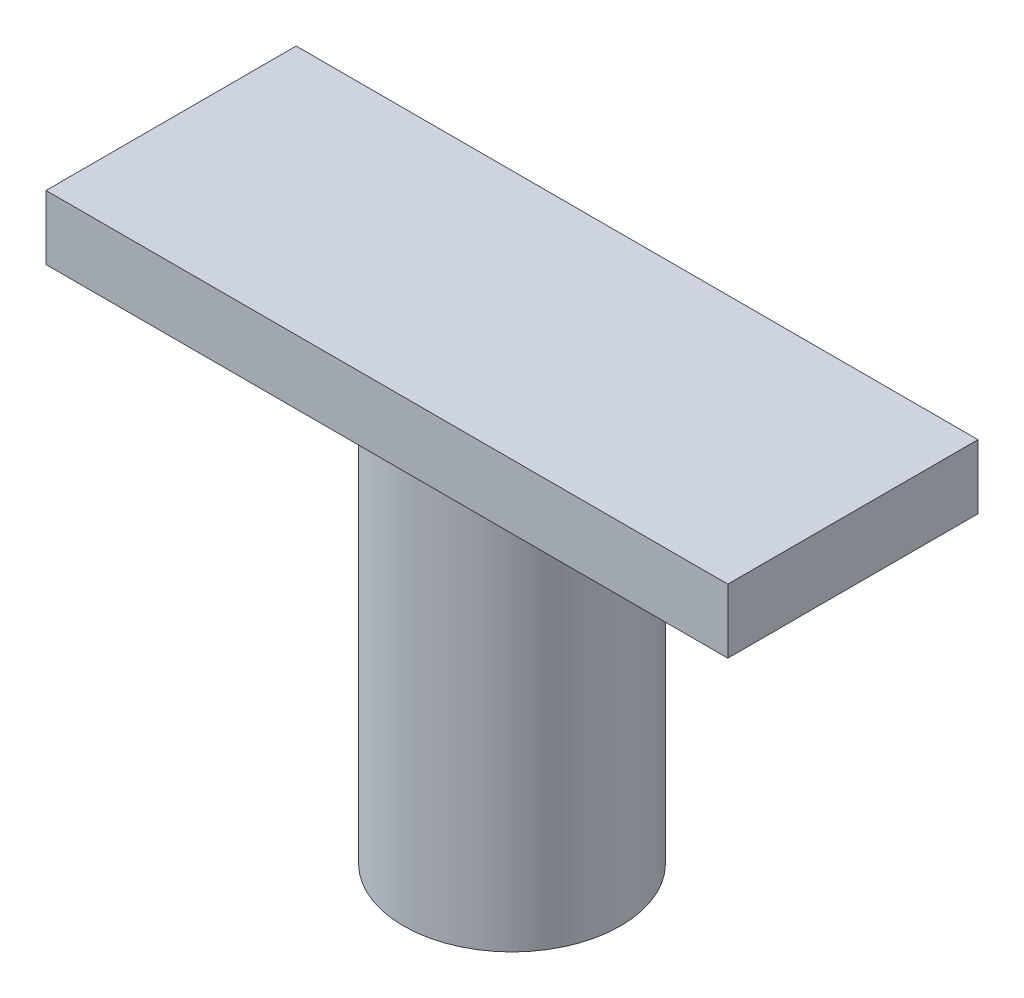
ISO-10303-21;
HEADER;
FILE_DESCRIPTION(('STEP AP214'),'2;1');
FILE_NAME('part.step','',(''),(''),'','','');
FILE_SCHEMA(('AUTOMOTIVE_DESIGN { 1 0 10303 214 1 1 1 1 }'));
ENDSEC;
DATA;
#1=APPLICATION_CONTEXT('core data for automotive mechanical design processes');
#2=APPLICATION_PROTOCOL_DEFINITION('international standard','automotive_design',2000,#1);
#3=PRODUCT_CONTEXT('',#1,'mechanical');
#4=PRODUCT('Part','Part','',(#3));
#5=PRODUCT_RELATED_PRODUCT_CATEGORY('part','',(#4));
#6=PRODUCT_DEFINITION_FORMATION('','',#4);
#7=PRODUCT_DEFINITION_CONTEXT('part definition',#1,'design');
#8=PRODUCT_DEFINITION('design','',#6,#7);
#9=PRODUCT_DEFINITION_SHAPE('','',#8);
#10=(LENGTH_UNIT() NAMED_UNIT(*) SI_UNIT(.MILLI.,.METRE.));
#11=(NAMED_UNIT(*) PLANE_ANGLE_UNIT() SI_UNIT($,.RADIAN.));
#12=(NAMED_UNIT(*) SI_UNIT($,.STERADIAN.) SOLID_ANGLE_UNIT());
#13=UNCERTAINTY_MEASURE_WITH_UNIT(LENGTH_MEASURE(1.E-05),#10,'distance_accuracy_value','');
#14=(GEOMETRIC_REPRESENTATION_CONTEXT(3) GLOBAL_UNCERTAINTY_ASSIGNED_CONTEXT((#13)) GLOBAL_UNIT_ASSIGNED_CONTEXT((#10,
#11,#12)) REPRESENTATION_CONTEXT('',''));
#15=CARTESIAN_POINT('',(0.,0.,0.));
#16=DIRECTION('',(0.,0.,1.));
#17=DIRECTION('',(1.,0.,0.));
#18=AXIS2_PLACEMENT_3D('',#15,#16,#17);
#19=CARTESIAN_POINT('',(22.7297936303225,64.,8.23955019099192));
#20=DIRECTION('',(0.,-1.,0.));
#21=DIRECTION('',(0.,0.,-1.));
#22=AXIS2_PLACEMENT_3D('',#19,#20,#21);
#23=CYLINDRICAL_SURFACE('',#22,16.9166212319845);
#24=CARTESIAN_POINT('',(22.7297936303225,64.,8.23955019099192));
#25=DIRECTION('',(0.,1.,0.));
#26=DIRECTION('',(0.,0.,1.));
#27=AXIS2_PLACEMENT_3D('',#24,#25,#26);
#28=CIRCLE('',#27,16.9166212319845);
#29=CARTESIAN_POINT('',(22.7297936303225,64.,25.1561714229764));
#30=VERTEX_POINT('',#29);
#31=EDGE_CURVE('E11',#30,#30,#28,.T.);
#32=ORIENTED_EDGE('',*,*,#31,.F.);
#33=EDGE_LOOP('',(#32));
#34=FACE_BOUND('',#33,.T.);
#35=CARTESIAN_POINT('',(22.7297936303225,0.,8.23955019099192));
#36=DIRECTION('',(0.,1.,0.));
#37=DIRECTION('',(0.,0.,1.));
#38=AXIS2_PLACEMENT_3D('',#35,#36,#37);
#39=CIRCLE('',#38,16.9166212319845);
#40=CARTESIAN_POINT('',(22.7297936303225,0.,25.1561714229764));
#41=VERTEX_POINT('',#40);
#42=EDGE_CURVE('E37',#41,#41,#39,.T.);
#43=ORIENTED_EDGE('',*,*,#42,.T.);
#44=EDGE_LOOP('',(#43));
#45=FACE_BOUND('',#44,.T.);
#46=ADVANCED_FACE('F34',(#34,#45),#23,.T.);
#47=CARTESIAN_POINT('',(22.7297936303225,0.,8.23955019099192));
#48=DIRECTION('',(0.,1.,0.));
#49=DIRECTION('',(0.,0.,1.));
#50=AXIS2_PLACEMENT_3D('',#47,#48,#49);
#51=PLANE('',#50);
#52=ORIENTED_EDGE('',*,*,#42,.F.);
#53=EDGE_LOOP('',(#52));
#54=FACE_BOUND('',#53,.T.);
#55=ADVANCED_FACE('F113',(#54),#51,.F.);
#56=CARTESIAN_POINT('',(75.8612808741503,74.,27.7333898328038));
#57=DIRECTION('',(-1.,0.,0.));
#58=DIRECTION('',(0.,0.,1.));
#59=AXIS2_PLACEMENT_3D('',#56,#57,#58);
#60=PLANE('',#59);
#61=DIRECTION('',(0.,0.,-1.));
#62=VECTOR('',#61,1.);
#63=CARTESIAN_POINT('',(75.8612808741503,64.,27.7333898328038));
#64=LINE('',#63,#62);
#65=CARTESIAN_POINT('',(75.8612808741503,64.,27.7333898328038));
#66=VERTEX_POINT('',#65);
#67=CARTESIAN_POINT('',(75.8612808741503,64.,-11.25428945082));
#68=VERTEX_POINT('',#67);
#69=EDGE_CURVE('E101',#66,#68,#64,.T.);
#70=ORIENTED_EDGE('',*,*,#69,.T.);
#71=DIRECTION('',(0.,-1.,0.));
#72=VECTOR('',#71,1.);
#73=CARTESIAN_POINT('',(75.8612808741503,74.,-11.25428945082));
#74=LINE('',#73,#72);
#75=CARTESIAN_POINT('',(75.8612808741503,74.,-11.25428945082));
#76=VERTEX_POINT('',#75);
#77=EDGE_CURVE('E92',#76,#68,#74,.T.);
#78=ORIENTED_EDGE('',*,*,#77,.F.);
#79=DIRECTION('',(0.,0.,-1.));
#80=VECTOR('',#79,1.);
#81=CARTESIAN_POINT('',(75.8612808741503,74.,27.7333898328038));
#82=LINE('',#81,#80);
#83=CARTESIAN_POINT('',(75.8612808741503,74.,27.7333898328038));
#84=VERTEX_POINT('',#83);
#85=EDGE_CURVE('E86',#84,#76,#82,.T.);
#86=ORIENTED_EDGE('',*,*,#85,.F.);
#87=DIRECTION('',(0.,-1.,0.));
#88=VECTOR('',#87,1.);
#89=CARTESIAN_POINT('',(75.8612808741503,74.,27.7333898328038));
#90=LINE('',#89,#88);
#91=EDGE_CURVE('E97',#84,#66,#90,.T.);
#92=ORIENTED_EDGE('',*,*,#91,.T.);
#93=EDGE_LOOP('',(#70,#78,#86,#92));
#94=FACE_BOUND('',#93,.T.);
#95=ADVANCED_FACE('F115',(#94),#60,.F.);
#96=CARTESIAN_POINT('',(-30.4016936135053,74.,-11.25428945082));
#97=DIRECTION('',(0.,0.,1.));
#98=DIRECTION('',(1.,0.,0.));
#99=AXIS2_PLACEMENT_3D('',#96,#97,#98);
#100=PLANE('',#99);
#101=DIRECTION('',(-1.,0.,0.));
#102=VECTOR('',#101,1.);
#103=CARTESIAN_POINT('',(-30.4016936135053,64.,-11.25428945082));
#104=LINE('',#103,#102);
#105=CARTESIAN_POINT('',(-30.4016936135053,64.,-11.25428945082));
#106=VERTEX_POINT('',#105);
#107=EDGE_CURVE('E91',#68,#106,#104,.T.);
#108=ORIENTED_EDGE('',*,*,#107,.T.);
#109=DIRECTION('',(0.,-1.,0.));
#110=VECTOR('',#109,1.);
#111=CARTESIAN_POINT('',(-30.4016936135053,74.,-11.25428945082));
#112=LINE('',#111,#110);
#113=CARTESIAN_POINT('',(-30.4016936135053,74.,-11.25428945082));
#114=VERTEX_POINT('',#113);
#115=EDGE_CURVE('E89',#114,#106,#112,.T.);
#116=ORIENTED_EDGE('',*,*,#115,.F.);
#117=DIRECTION('',(-1.,0.,0.));
#118=VECTOR('',#117,1.);
#119=CARTESIAN_POINT('',(-30.4016936135053,74.,-11.25428945082));
#120=LINE('',#119,#118);
#121=EDGE_CURVE('E81',#76,#114,#120,.T.);
#122=ORIENTED_EDGE('',*,*,#121,.F.);
#123=ORIENTED_EDGE('',*,*,#77,.T.);
#124=EDGE_LOOP('',(#108,#116,#122,#123));
#125=FACE_BOUND('',#124,.T.);
#126=ADVANCED_FACE('F90',(#125),#100,.F.);
#127=CARTESIAN_POINT('',(-30.4016936135053,74.,27.7333898328038));
#128=DIRECTION('',(1.,0.,0.));
#129=DIRECTION('',(0.,0.,-1.));
#130=AXIS2_PLACEMENT_3D('',#127,#128,#129);
#131=PLANE('',#130);
#132=DIRECTION('',(0.,0.,1.));
#133=VECTOR('',#132,1.);
#134=CARTESIAN_POINT('',(-30.4016936135053,64.,27.7333898328038));
#135=LINE('',#134,#133);
#136=CARTESIAN_POINT('',(-30.4016936135053,64.,27.7333898328038));
#137=VERTEX_POINT('',#136);
#138=EDGE_CURVE('E67',#106,#137,#135,.T.);
#139=ORIENTED_EDGE('',*,*,#138,.T.);
#140=DIRECTION('',(0.,-1.,0.));
#141=VECTOR('',#140,1.);
#142=CARTESIAN_POINT('',(-30.4016936135053,74.,27.7333898328038));
#143=LINE('',#142,#141);
#144=CARTESIAN_POINT('',(-30.4016936135053,74.,27.7333898328038));
#145=VERTEX_POINT('',#144);
#146=EDGE_CURVE('E93',#145,#137,#143,.T.);
#147=ORIENTED_EDGE('',*,*,#146,.F.);
#148=DIRECTION('',(0.,0.,1.));
#149=VECTOR('',#148,1.);
#150=CARTESIAN_POINT('',(-30.4016936135053,74.,27.7333898328038));
#151=LINE('',#150,#149);
#152=EDGE_CURVE('E84',#114,#145,#151,.T.);
#153=ORIENTED_EDGE('',*,*,#152,.F.);
#154=ORIENTED_EDGE('',*,*,#115,.T.);
#155=EDGE_LOOP('',(#139,#147,#153,#154));
#156=FACE_BOUND('',#155,.T.);
#157=ADVANCED_FACE('F95',(#156),#131,.F.);
#158=CARTESIAN_POINT('',(-30.4016936135053,74.,27.7333898328038));
#159=DIRECTION('',(0.,0.,-1.));
#160=DIRECTION('',(-1.,0.,0.));
#161=AXIS2_PLACEMENT_3D('',#158,#159,#160);
#162=PLANE('',#161);
#163=DIRECTION('',(1.,0.,0.));
#164=VECTOR('',#163,1.);
#165=CARTESIAN_POINT('',(-30.4016936135053,64.,27.7333898328038));
#166=LINE('',#165,#164);
#167=EDGE_CURVE('E73',#137,#66,#166,.T.);
#168=ORIENTED_EDGE('',*,*,#167,.T.);
#169=ORIENTED_EDGE('',*,*,#91,.F.);
#170=DIRECTION('',(1.,0.,0.));
#171=VECTOR('',#170,1.);
#172=CARTESIAN_POINT('',(-30.4016936135053,74.,27.7333898328038));
#173=LINE('',#172,#171);
#174=EDGE_CURVE('E50',#145,#84,#173,.T.);
#175=ORIENTED_EDGE('',*,*,#174,.F.);
#176=ORIENTED_EDGE('',*,*,#146,.T.);
#177=EDGE_LOOP('',(#168,#169,#175,#176));
#178=FACE_BOUND('',#177,.T.);
#179=ADVANCED_FACE('F128',(#178),#162,.F.);
#180=CARTESIAN_POINT('',(0.,74.,0.));
#181=DIRECTION('',(0.,-1.,0.));
#182=DIRECTION('',(0.,0.,-1.));
#183=AXIS2_PLACEMENT_3D('',#180,#181,#182);
#184=PLANE('',#183);
#185=ORIENTED_EDGE('',*,*,#85,.T.);
#186=ORIENTED_EDGE('',*,*,#121,.T.);
#187=ORIENTED_EDGE('',*,*,#152,.T.);
#188=ORIENTED_EDGE('',*,*,#174,.T.);
#189=EDGE_LOOP('',(#185,#186,#187,#188));
#190=FACE_BOUND('',#189,.T.);
#191=ADVANCED_FACE('F82',(#190),#184,.F.);
#192=CARTESIAN_POINT('',(0.,64.,0.));
#193=DIRECTION('',(0.,-1.,0.));
#194=DIRECTION('',(0.,0.,-1.));
#195=AXIS2_PLACEMENT_3D('',#192,#193,#194);
#196=PLANE('',#195);
#197=ORIENTED_EDGE('',*,*,#31,.T.);
#198=EDGE_LOOP('',(#197));
#199=FACE_BOUND('',#198,.T.);
#200=ORIENTED_EDGE('',*,*,#69,.F.);
#201=ORIENTED_EDGE('',*,*,#167,.F.);
#202=ORIENTED_EDGE('',*,*,#138,.F.);
#203=ORIENTED_EDGE('',*,*,#107,.F.);
#204=EDGE_LOOP('',(#200,#201,#202,#203));
#205=FACE_BOUND('',#204,.T.);
#206=ADVANCED_FACE('F131',(#199,#205),#196,.T.);
#207=CLOSED_SHELL('',(#46,#55,#95,#126,#157,#179,#191,#206));
#208=MANIFOLD_SOLID_BREP('B2',#207);
#209=ADVANCED_BREP_SHAPE_REPRESENTATION('',(#18,#208),#14);
#210=SHAPE_DEFINITION_REPRESENTATION(#9,#209);
ENDSEC;
END-ISO-10303-21;
